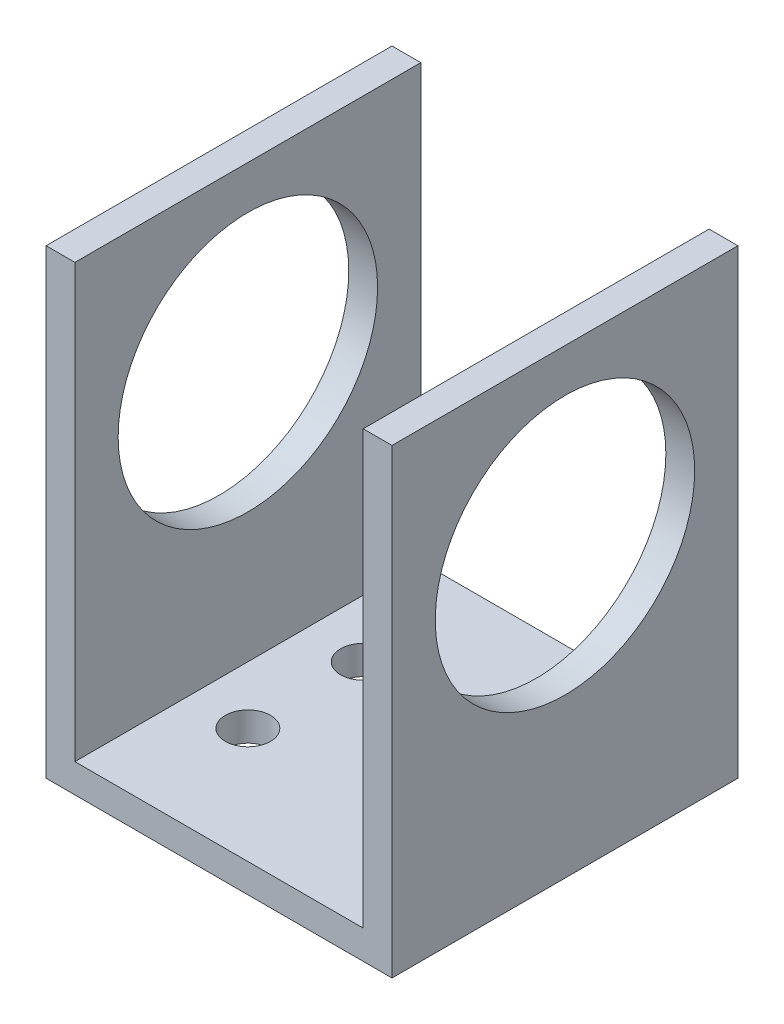
ISO-10303-21;
HEADER;
FILE_DESCRIPTION(('STEP AP214'),'2;1');
FILE_NAME('part.step','',(''),(''),'','','');
FILE_SCHEMA(('AUTOMOTIVE_DESIGN { 1 0 10303 214 1 1 1 1 }'));
ENDSEC;
DATA;
#1=APPLICATION_CONTEXT('core data for automotive mechanical design processes');
#2=APPLICATION_PROTOCOL_DEFINITION('international standard','automotive_design',2000,#1);
#3=PRODUCT_CONTEXT('',#1,'mechanical');
#4=PRODUCT('Part','Part','',(#3));
#5=PRODUCT_RELATED_PRODUCT_CATEGORY('part','',(#4));
#6=PRODUCT_DEFINITION_FORMATION('','',#4);
#7=PRODUCT_DEFINITION_CONTEXT('part definition',#1,'design');
#8=PRODUCT_DEFINITION('design','',#6,#7);
#9=PRODUCT_DEFINITION_SHAPE('','',#8);
#10=(LENGTH_UNIT() NAMED_UNIT(*) SI_UNIT(.MILLI.,.METRE.));
#11=(NAMED_UNIT(*) PLANE_ANGLE_UNIT() SI_UNIT($,.RADIAN.));
#12=(NAMED_UNIT(*) SI_UNIT($,.STERADIAN.) SOLID_ANGLE_UNIT());
#13=UNCERTAINTY_MEASURE_WITH_UNIT(LENGTH_MEASURE(1.E-05),#10,'distance_accuracy_value','');
#14=(GEOMETRIC_REPRESENTATION_CONTEXT(3) GLOBAL_UNCERTAINTY_ASSIGNED_CONTEXT((#13)) GLOBAL_UNIT_ASSIGNED_CONTEXT((#10,
#11,#12)) REPRESENTATION_CONTEXT('',''));
#15=CARTESIAN_POINT('',(0.,0.,0.));
#16=DIRECTION('',(0.,0.,1.));
#17=DIRECTION('',(1.,0.,0.));
#18=AXIS2_PLACEMENT_3D('',#15,#16,#17);
#19=CARTESIAN_POINT('',(38.1,0.,38.1));
#20=DIRECTION('',(0.,1.,0.));
#21=DIRECTION('',(0.,0.,1.));
#22=AXIS2_PLACEMENT_3D('',#19,#20,#21);
#23=PLANE('',#22);
#24=CARTESIAN_POINT('',(28.575,0.,12.7));
#25=DIRECTION('',(0.,1.,0.));
#26=DIRECTION('',(-1.,0.,0.));
#27=AXIS2_PLACEMENT_3D('',#24,#25,#26);
#28=CIRCLE('',#27,2.4892);
#29=CARTESIAN_POINT('',(26.0858,0.,12.7));
#30=VERTEX_POINT('',#29);
#31=EDGE_CURVE('E198',#30,#30,#28,.T.);
#32=ORIENTED_EDGE('',*,*,#31,.T.);
#33=EDGE_LOOP('',(#32));
#34=FACE_BOUND('',#33,.T.);
#35=CARTESIAN_POINT('',(28.575,0.,25.4));
#36=DIRECTION('',(0.,1.,0.));
#37=DIRECTION('',(-1.,0.,0.));
#38=AXIS2_PLACEMENT_3D('',#35,#36,#37);
#39=CIRCLE('',#38,2.4892);
#40=CARTESIAN_POINT('',(26.0858,0.,25.4));
#41=VERTEX_POINT('',#40);
#42=EDGE_CURVE('E204',#41,#41,#39,.T.);
#43=ORIENTED_EDGE('',*,*,#42,.T.);
#44=EDGE_LOOP('',(#43));
#45=FACE_BOUND('',#44,.T.);
#46=CARTESIAN_POINT('',(9.52499999999999,0.,25.4));
#47=DIRECTION('',(0.,1.,0.));
#48=DIRECTION('',(-1.,0.,0.));
#49=AXIS2_PLACEMENT_3D('',#46,#47,#48);
#50=CIRCLE('',#49,2.4892);
#51=CARTESIAN_POINT('',(7.03579999999999,0.,25.4));
#52=VERTEX_POINT('',#51);
#53=EDGE_CURVE('E192',#52,#52,#50,.T.);
#54=ORIENTED_EDGE('',*,*,#53,.T.);
#55=EDGE_LOOP('',(#54));
#56=FACE_BOUND('',#55,.T.);
#57=CARTESIAN_POINT('',(9.52499999999999,0.,12.7));
#58=DIRECTION('',(0.,1.,0.));
#59=DIRECTION('',(-1.,0.,0.));
#60=AXIS2_PLACEMENT_3D('',#57,#58,#59);
#61=CIRCLE('',#60,2.4892);
#62=CARTESIAN_POINT('',(7.03579999999999,0.,12.7));
#63=VERTEX_POINT('',#62);
#64=EDGE_CURVE('E186',#63,#63,#61,.T.);
#65=ORIENTED_EDGE('',*,*,#64,.T.);
#66=EDGE_LOOP('',(#65));
#67=FACE_BOUND('',#66,.T.);
#68=DIRECTION('',(1.,0.,0.));
#69=VECTOR('',#68,1.);
#70=CARTESIAN_POINT('',(38.1,0.,0.));
#71=LINE('',#70,#69);
#72=CARTESIAN_POINT('',(0.,0.,0.));
#73=VERTEX_POINT('',#72);
#74=CARTESIAN_POINT('',(38.1,0.,0.));
#75=VERTEX_POINT('',#74);
#76=EDGE_CURVE('E129',#73,#75,#71,.T.);
#77=ORIENTED_EDGE('',*,*,#76,.T.);
#78=DIRECTION('',(0.,0.,-1.));
#79=VECTOR('',#78,1.);
#80=CARTESIAN_POINT('',(38.1,0.,38.1));
#81=LINE('',#80,#79);
#82=CARTESIAN_POINT('',(38.1,0.,38.1));
#83=VERTEX_POINT('',#82);
#84=EDGE_CURVE('E11',#83,#75,#81,.T.);
#85=ORIENTED_EDGE('',*,*,#84,.F.);
#86=DIRECTION('',(1.,0.,0.));
#87=VECTOR('',#86,1.);
#88=CARTESIAN_POINT('',(38.1,0.,38.1));
#89=LINE('',#88,#87);
#90=CARTESIAN_POINT('',(0.,0.,38.1));
#91=VERTEX_POINT('',#90);
#92=EDGE_CURVE('E144',#91,#83,#89,.T.);
#93=ORIENTED_EDGE('',*,*,#92,.F.);
#94=DIRECTION('',(0.,0.,-1.));
#95=VECTOR('',#94,1.);
#96=CARTESIAN_POINT('',(0.,0.,38.1));
#97=LINE('',#96,#95);
#98=EDGE_CURVE('E125',#91,#73,#97,.T.);
#99=ORIENTED_EDGE('',*,*,#98,.T.);
#100=EDGE_LOOP('',(#77,#85,#93,#99));
#101=FACE_BOUND('',#100,.T.);
#102=ADVANCED_FACE('F33',(#34,#45,#56,#67,#101),#23,.F.);
#103=CARTESIAN_POINT('',(38.1,50.8,38.1));
#104=DIRECTION('',(-1.,0.,0.));
#105=DIRECTION('',(0.,0.,1.));
#106=AXIS2_PLACEMENT_3D('',#103,#104,#105);
#107=PLANE('',#106);
#108=CARTESIAN_POINT('',(38.1,31.75,19.05));
#109=DIRECTION('',(1.,0.,0.));
#110=DIRECTION('',(0.,0.,-1.));
#111=AXIS2_PLACEMENT_3D('',#108,#109,#110);
#112=CIRCLE('',#111,14.2875);
#113=CARTESIAN_POINT('',(38.1,31.75,4.7625));
#114=VERTEX_POINT('',#113);
#115=EDGE_CURVE('E183',#114,#114,#112,.T.);
#116=ORIENTED_EDGE('',*,*,#115,.F.);
#117=EDGE_LOOP('',(#116));
#118=FACE_BOUND('',#117,.T.);
#119=DIRECTION('',(0.,1.,0.));
#120=VECTOR('',#119,1.);
#121=CARTESIAN_POINT('',(38.1,50.8,0.));
#122=LINE('',#121,#120);
#123=CARTESIAN_POINT('',(38.1,50.8,0.));
#124=VERTEX_POINT('',#123);
#125=EDGE_CURVE('E132',#75,#124,#122,.T.);
#126=ORIENTED_EDGE('',*,*,#125,.T.);
#127=DIRECTION('',(0.,0.,-1.));
#128=VECTOR('',#127,1.);
#129=CARTESIAN_POINT('',(38.1,50.8,38.1));
#130=LINE('',#129,#128);
#131=CARTESIAN_POINT('',(38.1,50.8,38.1));
#132=VERTEX_POINT('',#131);
#133=EDGE_CURVE('E41',#132,#124,#130,.T.);
#134=ORIENTED_EDGE('',*,*,#133,.F.);
#135=DIRECTION('',(0.,1.,0.));
#136=VECTOR('',#135,1.);
#137=CARTESIAN_POINT('',(38.1,50.8,38.1));
#138=LINE('',#137,#136);
#139=EDGE_CURVE('E92',#83,#132,#138,.T.);
#140=ORIENTED_EDGE('',*,*,#139,.F.);
#141=ORIENTED_EDGE('',*,*,#84,.T.);
#142=EDGE_LOOP('',(#126,#134,#140,#141));
#143=FACE_BOUND('',#142,.T.);
#144=ADVANCED_FACE('F242',(#118,#143),#107,.F.);
#145=CARTESIAN_POINT('',(34.925,50.8,38.1));
#146=DIRECTION('',(0.,-1.,0.));
#147=DIRECTION('',(0.,0.,-1.));
#148=AXIS2_PLACEMENT_3D('',#145,#146,#147);
#149=PLANE('',#148);
#150=DIRECTION('',(-1.,0.,0.));
#151=VECTOR('',#150,1.);
#152=CARTESIAN_POINT('',(34.925,50.8,0.));
#153=LINE('',#152,#151);
#154=CARTESIAN_POINT('',(34.925,50.8,0.));
#155=VERTEX_POINT('',#154);
#156=EDGE_CURVE('E135',#124,#155,#153,.T.);
#157=ORIENTED_EDGE('',*,*,#156,.T.);
#158=DIRECTION('',(0.,0.,-1.));
#159=VECTOR('',#158,1.);
#160=CARTESIAN_POINT('',(34.925,50.8,38.1));
#161=LINE('',#160,#159);
#162=CARTESIAN_POINT('',(34.925,50.8,38.1));
#163=VERTEX_POINT('',#162);
#164=EDGE_CURVE('E151',#163,#155,#161,.T.);
#165=ORIENTED_EDGE('',*,*,#164,.F.);
#166=DIRECTION('',(-1.,0.,0.));
#167=VECTOR('',#166,1.);
#168=CARTESIAN_POINT('',(34.925,50.8,38.1));
#169=LINE('',#168,#167);
#170=EDGE_CURVE('E159',#132,#163,#169,.T.);
#171=ORIENTED_EDGE('',*,*,#170,.F.);
#172=ORIENTED_EDGE('',*,*,#133,.T.);
#173=EDGE_LOOP('',(#157,#165,#171,#172));
#174=FACE_BOUND('',#173,.T.);
#175=ADVANCED_FACE('F157',(#174),#149,.F.);
#176=CARTESIAN_POINT('',(34.925,3.17499999999998,38.1));
#177=DIRECTION('',(1.,0.,0.));
#178=DIRECTION('',(0.,1.,0.));
#179=AXIS2_PLACEMENT_3D('',#176,#177,#178);
#180=PLANE('',#179);
#181=CARTESIAN_POINT('',(34.925,31.75,19.05));
#182=DIRECTION('',(1.,0.,0.));
#183=DIRECTION('',(0.,1.,0.));
#184=AXIS2_PLACEMENT_3D('',#181,#182,#183);
#185=CIRCLE('',#184,14.2875);
#186=CARTESIAN_POINT('',(34.925,46.0375,19.05));
#187=VERTEX_POINT('',#186);
#188=EDGE_CURVE('E133',#187,#187,#185,.T.);
#189=ORIENTED_EDGE('',*,*,#188,.T.);
#190=EDGE_LOOP('',(#189));
#191=FACE_BOUND('',#190,.T.);
#192=DIRECTION('',(0.,-1.,0.));
#193=VECTOR('',#192,1.);
#194=CARTESIAN_POINT('',(34.925,3.17499999999998,0.));
#195=LINE('',#194,#193);
#196=CARTESIAN_POINT('',(34.925,3.17499999999998,0.));
#197=VERTEX_POINT('',#196);
#198=EDGE_CURVE('E137',#155,#197,#195,.T.);
#199=ORIENTED_EDGE('',*,*,#198,.T.);
#200=DIRECTION('',(0.,0.,-1.));
#201=VECTOR('',#200,1.);
#202=CARTESIAN_POINT('',(34.925,3.17499999999998,38.1));
#203=LINE('',#202,#201);
#204=CARTESIAN_POINT('',(34.925,3.17499999999998,38.1));
#205=VERTEX_POINT('',#204);
#206=EDGE_CURVE('E148',#205,#197,#203,.T.);
#207=ORIENTED_EDGE('',*,*,#206,.F.);
#208=DIRECTION('',(0.,-1.,0.));
#209=VECTOR('',#208,1.);
#210=CARTESIAN_POINT('',(34.925,3.17499999999998,38.1));
#211=LINE('',#210,#209);
#212=EDGE_CURVE('E171',#163,#205,#211,.T.);
#213=ORIENTED_EDGE('',*,*,#212,.F.);
#214=ORIENTED_EDGE('',*,*,#164,.T.);
#215=EDGE_LOOP('',(#199,#207,#213,#214));
#216=FACE_BOUND('',#215,.T.);
#217=ADVANCED_FACE('F167',(#191,#216),#180,.F.);
#218=CARTESIAN_POINT('',(3.17499999999999,3.17499999999999,38.1));
#219=DIRECTION('',(0.,-1.,0.));
#220=DIRECTION('',(1.,0.,0.));
#221=AXIS2_PLACEMENT_3D('',#218,#219,#220);
#222=PLANE('',#221);
#223=CARTESIAN_POINT('',(28.575,3.17499999999998,12.7));
#224=DIRECTION('',(0.,1.,0.));
#225=DIRECTION('',(-1.,0.,0.));
#226=AXIS2_PLACEMENT_3D('',#223,#224,#225);
#227=CIRCLE('',#226,2.4892);
#228=CARTESIAN_POINT('',(26.0858,3.17499999999998,12.7));
#229=VERTEX_POINT('',#228);
#230=EDGE_CURVE('E195',#229,#229,#227,.T.);
#231=ORIENTED_EDGE('',*,*,#230,.F.);
#232=EDGE_LOOP('',(#231));
#233=FACE_BOUND('',#232,.T.);
#234=CARTESIAN_POINT('',(28.575,3.17499999999998,25.4));
#235=DIRECTION('',(0.,1.,0.));
#236=DIRECTION('',(-1.,0.,0.));
#237=AXIS2_PLACEMENT_3D('',#234,#235,#236);
#238=CIRCLE('',#237,2.4892);
#239=CARTESIAN_POINT('',(26.0858,3.17499999999998,25.4));
#240=VERTEX_POINT('',#239);
#241=EDGE_CURVE('E201',#240,#240,#238,.T.);
#242=ORIENTED_EDGE('',*,*,#241,.F.);
#243=EDGE_LOOP('',(#242));
#244=FACE_BOUND('',#243,.T.);
#245=CARTESIAN_POINT('',(9.52499999999999,3.17499999999998,25.4));
#246=DIRECTION('',(0.,1.,0.));
#247=DIRECTION('',(-1.,0.,0.));
#248=AXIS2_PLACEMENT_3D('',#245,#246,#247);
#249=CIRCLE('',#248,2.4892);
#250=CARTESIAN_POINT('',(7.03579999999999,3.17499999999998,25.4));
#251=VERTEX_POINT('',#250);
#252=EDGE_CURVE('E207',#251,#251,#249,.T.);
#253=ORIENTED_EDGE('',*,*,#252,.F.);
#254=EDGE_LOOP('',(#253));
#255=FACE_BOUND('',#254,.T.);
#256=CARTESIAN_POINT('',(9.52499999999999,3.17499999999998,12.7));
#257=DIRECTION('',(0.,1.,0.));
#258=DIRECTION('',(-1.,0.,0.));
#259=AXIS2_PLACEMENT_3D('',#256,#257,#258);
#260=CIRCLE('',#259,2.4892);
#261=CARTESIAN_POINT('',(7.03579999999999,3.17499999999998,12.7));
#262=VERTEX_POINT('',#261);
#263=EDGE_CURVE('E189',#262,#262,#260,.T.);
#264=ORIENTED_EDGE('',*,*,#263,.F.);
#265=EDGE_LOOP('',(#264));
#266=FACE_BOUND('',#265,.T.);
#267=DIRECTION('',(-1.,0.,0.));
#268=VECTOR('',#267,1.);
#269=CARTESIAN_POINT('',(3.17499999999999,3.17499999999999,0.));
#270=LINE('',#269,#268);
#271=CARTESIAN_POINT('',(3.17499999999999,3.17499999999999,0.));
#272=VERTEX_POINT('',#271);
#273=EDGE_CURVE('E139',#197,#272,#270,.T.);
#274=ORIENTED_EDGE('',*,*,#273,.T.);
#275=DIRECTION('',(0.,0.,-1.));
#276=VECTOR('',#275,1.);
#277=CARTESIAN_POINT('',(3.17499999999999,3.17499999999999,38.1));
#278=LINE('',#277,#276);
#279=CARTESIAN_POINT('',(3.17499999999999,3.17499999999999,38.1));
#280=VERTEX_POINT('',#279);
#281=EDGE_CURVE('E120',#280,#272,#278,.T.);
#282=ORIENTED_EDGE('',*,*,#281,.F.);
#283=DIRECTION('',(-1.,0.,0.));
#284=VECTOR('',#283,1.);
#285=CARTESIAN_POINT('',(3.17499999999999,3.17499999999999,38.1));
#286=LINE('',#285,#284);
#287=EDGE_CURVE('E111',#205,#280,#286,.T.);
#288=ORIENTED_EDGE('',*,*,#287,.F.);
#289=ORIENTED_EDGE('',*,*,#206,.T.);
#290=EDGE_LOOP('',(#274,#282,#288,#289));
#291=FACE_BOUND('',#290,.T.);
#292=ADVANCED_FACE('F170',(#233,#244,#255,#266,#291),#222,.F.);
#293=CARTESIAN_POINT('',(3.17499999999999,50.8,38.1));
#294=DIRECTION('',(-1.,0.,0.));
#295=DIRECTION('',(0.,0.,1.));
#296=AXIS2_PLACEMENT_3D('',#293,#294,#295);
#297=PLANE('',#296);
#298=CARTESIAN_POINT('',(3.17499999999999,31.75,19.05));
#299=DIRECTION('',(-1.,0.,0.));
#300=DIRECTION('',(0.,0.,1.));
#301=AXIS2_PLACEMENT_3D('',#298,#299,#300);
#302=CIRCLE('',#301,14.2875);
#303=CARTESIAN_POINT('',(3.17499999999999,31.75,33.3375));
#304=VERTEX_POINT('',#303);
#305=EDGE_CURVE('E179',#304,#304,#302,.T.);
#306=ORIENTED_EDGE('',*,*,#305,.T.);
#307=EDGE_LOOP('',(#306));
#308=FACE_BOUND('',#307,.T.);
#309=DIRECTION('',(0.,1.,0.));
#310=VECTOR('',#309,1.);
#311=CARTESIAN_POINT('',(3.17499999999999,50.8,0.));
#312=LINE('',#311,#310);
#313=CARTESIAN_POINT('',(3.17499999999999,50.8,0.));
#314=VERTEX_POINT('',#313);
#315=EDGE_CURVE('E119',#272,#314,#312,.T.);
#316=ORIENTED_EDGE('',*,*,#315,.T.);
#317=DIRECTION('',(0.,0.,-1.));
#318=VECTOR('',#317,1.);
#319=CARTESIAN_POINT('',(3.17499999999999,50.8,38.1));
#320=LINE('',#319,#318);
#321=CARTESIAN_POINT('',(3.17499999999999,50.8,38.1));
#322=VERTEX_POINT('',#321);
#323=EDGE_CURVE('E116',#322,#314,#320,.T.);
#324=ORIENTED_EDGE('',*,*,#323,.F.);
#325=DIRECTION('',(0.,1.,0.));
#326=VECTOR('',#325,1.);
#327=CARTESIAN_POINT('',(3.17499999999999,50.8,38.1));
#328=LINE('',#327,#326);
#329=EDGE_CURVE('E105',#280,#322,#328,.T.);
#330=ORIENTED_EDGE('',*,*,#329,.F.);
#331=ORIENTED_EDGE('',*,*,#281,.T.);
#332=EDGE_LOOP('',(#316,#324,#330,#331));
#333=FACE_BOUND('',#332,.T.);
#334=ADVANCED_FACE('F117',(#308,#333),#297,.F.);
#335=CARTESIAN_POINT('',(0.,50.8,38.1));
#336=DIRECTION('',(0.,-1.,0.));
#337=DIRECTION('',(0.,0.,-1.));
#338=AXIS2_PLACEMENT_3D('',#335,#336,#337);
#339=PLANE('',#338);
#340=DIRECTION('',(-1.,0.,0.));
#341=VECTOR('',#340,1.);
#342=CARTESIAN_POINT('',(0.,50.8,0.));
#343=LINE('',#342,#341);
#344=CARTESIAN_POINT('',(0.,50.8,0.));
#345=VERTEX_POINT('',#344);
#346=EDGE_CURVE('E78',#314,#345,#343,.T.);
#347=ORIENTED_EDGE('',*,*,#346,.T.);
#348=DIRECTION('',(0.,0.,-1.));
#349=VECTOR('',#348,1.);
#350=CARTESIAN_POINT('',(0.,50.8,38.1));
#351=LINE('',#350,#349);
#352=CARTESIAN_POINT('',(0.,50.8,38.1));
#353=VERTEX_POINT('',#352);
#354=EDGE_CURVE('E121',#353,#345,#351,.T.);
#355=ORIENTED_EDGE('',*,*,#354,.F.);
#356=DIRECTION('',(-1.,0.,0.));
#357=VECTOR('',#356,1.);
#358=CARTESIAN_POINT('',(0.,50.8,38.1));
#359=LINE('',#358,#357);
#360=EDGE_CURVE('E109',#322,#353,#359,.T.);
#361=ORIENTED_EDGE('',*,*,#360,.F.);
#362=ORIENTED_EDGE('',*,*,#323,.T.);
#363=EDGE_LOOP('',(#347,#355,#361,#362));
#364=FACE_BOUND('',#363,.T.);
#365=ADVANCED_FACE('F123',(#364),#339,.F.);
#366=CARTESIAN_POINT('',(0.,0.,38.1));
#367=DIRECTION('',(1.,0.,0.));
#368=DIRECTION('',(0.,0.,-1.));
#369=AXIS2_PLACEMENT_3D('',#366,#367,#368);
#370=PLANE('',#369);
#371=CARTESIAN_POINT('',(0.,31.75,19.05));
#372=DIRECTION('',(1.,0.,0.));
#373=DIRECTION('',(0.,0.,-1.));
#374=AXIS2_PLACEMENT_3D('',#371,#372,#373);
#375=CIRCLE('',#374,14.2875);
#376=CARTESIAN_POINT('',(0.,31.75,4.7625));
#377=VERTEX_POINT('',#376);
#378=EDGE_CURVE('E182',#377,#377,#375,.T.);
#379=ORIENTED_EDGE('',*,*,#378,.T.);
#380=EDGE_LOOP('',(#379));
#381=FACE_BOUND('',#380,.T.);
#382=DIRECTION('',(0.,-1.,0.));
#383=VECTOR('',#382,1.);
#384=CARTESIAN_POINT('',(0.,0.,0.));
#385=LINE('',#384,#383);
#386=EDGE_CURVE('E84',#345,#73,#385,.T.);
#387=ORIENTED_EDGE('',*,*,#386,.T.);
#388=ORIENTED_EDGE('',*,*,#98,.F.);
#389=DIRECTION('',(0.,-1.,0.));
#390=VECTOR('',#389,1.);
#391=CARTESIAN_POINT('',(0.,0.,38.1));
#392=LINE('',#391,#390);
#393=EDGE_CURVE('E49',#353,#91,#392,.T.);
#394=ORIENTED_EDGE('',*,*,#393,.F.);
#395=ORIENTED_EDGE('',*,*,#354,.T.);
#396=EDGE_LOOP('',(#387,#388,#394,#395));
#397=FACE_BOUND('',#396,.T.);
#398=ADVANCED_FACE('F316',(#381,#397),#370,.F.);
#399=CARTESIAN_POINT('',(0.,0.,38.1));
#400=DIRECTION('',(0.,0.,-1.));
#401=DIRECTION('',(-1.,0.,0.));
#402=AXIS2_PLACEMENT_3D('',#399,#400,#401);
#403=PLANE('',#402);
#404=ORIENTED_EDGE('',*,*,#92,.T.);
#405=ORIENTED_EDGE('',*,*,#139,.T.);
#406=ORIENTED_EDGE('',*,*,#170,.T.);
#407=ORIENTED_EDGE('',*,*,#212,.T.);
#408=ORIENTED_EDGE('',*,*,#287,.T.);
#409=ORIENTED_EDGE('',*,*,#329,.T.);
#410=ORIENTED_EDGE('',*,*,#360,.T.);
#411=ORIENTED_EDGE('',*,*,#393,.T.);
#412=EDGE_LOOP('',(#404,#405,#406,#407,#408,#409,#410,#411));
#413=FACE_BOUND('',#412,.T.);
#414=ADVANCED_FACE('F107',(#413),#403,.F.);
#415=CARTESIAN_POINT('',(0.,0.,0.));
#416=DIRECTION('',(0.,0.,-1.));
#417=DIRECTION('',(-1.,0.,0.));
#418=AXIS2_PLACEMENT_3D('',#415,#416,#417);
#419=PLANE('',#418);
#420=ORIENTED_EDGE('',*,*,#76,.F.);
#421=ORIENTED_EDGE('',*,*,#386,.F.);
#422=ORIENTED_EDGE('',*,*,#346,.F.);
#423=ORIENTED_EDGE('',*,*,#315,.F.);
#424=ORIENTED_EDGE('',*,*,#273,.F.);
#425=ORIENTED_EDGE('',*,*,#198,.F.);
#426=ORIENTED_EDGE('',*,*,#156,.F.);
#427=ORIENTED_EDGE('',*,*,#125,.F.);
#428=EDGE_LOOP('',(#420,#421,#422,#423,#424,#425,#426,#427));
#429=FACE_BOUND('',#428,.T.);
#430=ADVANCED_FACE('F163',(#429),#419,.T.);
#431=CARTESIAN_POINT('',(0.,31.75,19.05));
#432=DIRECTION('',(1.,0.,0.));
#433=DIRECTION('',(0.,0.,-1.));
#434=AXIS2_PLACEMENT_3D('',#431,#432,#433);
#435=CYLINDRICAL_SURFACE('',#434,14.2875);
#436=ORIENTED_EDGE('',*,*,#378,.F.);
#437=EDGE_LOOP('',(#436));
#438=FACE_BOUND('',#437,.T.);
#439=ORIENTED_EDGE('',*,*,#305,.F.);
#440=EDGE_LOOP('',(#439));
#441=FACE_BOUND('',#440,.T.);
#442=ADVANCED_FACE('F236',(#438,#441),#435,.F.);
#443=ORIENTED_EDGE('',*,*,#115,.T.);
#444=EDGE_LOOP('',(#443));
#445=FACE_BOUND('',#444,.T.);
#446=ORIENTED_EDGE('',*,*,#188,.F.);
#447=EDGE_LOOP('',(#446));
#448=FACE_BOUND('',#447,.T.);
#449=ADVANCED_FACE('F230',(#445,#448),#435,.F.);
#450=CARTESIAN_POINT('',(9.52499999999999,0.,12.7));
#451=DIRECTION('',(0.,1.,0.));
#452=DIRECTION('',(-1.,0.,0.));
#453=AXIS2_PLACEMENT_3D('',#450,#451,#452);
#454=CYLINDRICAL_SURFACE('',#453,2.4892);
#455=ORIENTED_EDGE('',*,*,#64,.F.);
#456=EDGE_LOOP('',(#455));
#457=FACE_BOUND('',#456,.T.);
#458=ORIENTED_EDGE('',*,*,#263,.T.);
#459=EDGE_LOOP('',(#458));
#460=FACE_BOUND('',#459,.T.);
#461=ADVANCED_FACE('F219',(#457,#460),#454,.F.);
#462=CARTESIAN_POINT('',(9.52499999999999,0.,25.4));
#463=DIRECTION('',(0.,1.,0.));
#464=DIRECTION('',(-1.,0.,0.));
#465=AXIS2_PLACEMENT_3D('',#462,#463,#464);
#466=CYLINDRICAL_SURFACE('',#465,2.4892);
#467=ORIENTED_EDGE('',*,*,#53,.F.);
#468=EDGE_LOOP('',(#467));
#469=FACE_BOUND('',#468,.T.);
#470=ORIENTED_EDGE('',*,*,#252,.T.);
#471=EDGE_LOOP('',(#470));
#472=FACE_BOUND('',#471,.T.);
#473=ADVANCED_FACE('F215',(#469,#472),#466,.F.);
#474=CARTESIAN_POINT('',(28.575,0.,25.4));
#475=DIRECTION('',(0.,1.,0.));
#476=DIRECTION('',(-1.,0.,0.));
#477=AXIS2_PLACEMENT_3D('',#474,#475,#476);
#478=CYLINDRICAL_SURFACE('',#477,2.4892);
#479=ORIENTED_EDGE('',*,*,#42,.F.);
#480=EDGE_LOOP('',(#479));
#481=FACE_BOUND('',#480,.T.);
#482=ORIENTED_EDGE('',*,*,#241,.T.);
#483=EDGE_LOOP('',(#482));
#484=FACE_BOUND('',#483,.T.);
#485=ADVANCED_FACE('F218',(#481,#484),#478,.F.);
#486=CARTESIAN_POINT('',(28.575,0.,12.7));
#487=DIRECTION('',(0.,1.,0.));
#488=DIRECTION('',(-1.,0.,0.));
#489=AXIS2_PLACEMENT_3D('',#486,#487,#488);
#490=CYLINDRICAL_SURFACE('',#489,2.4892);
#491=ORIENTED_EDGE('',*,*,#31,.F.);
#492=EDGE_LOOP('',(#491));
#493=FACE_BOUND('',#492,.T.);
#494=ORIENTED_EDGE('',*,*,#230,.T.);
#495=EDGE_LOOP('',(#494));
#496=FACE_BOUND('',#495,.T.);
#497=ADVANCED_FACE('F254',(#493,#496),#490,.F.);
#498=CLOSED_SHELL('',(#102,#144,#175,#217,#292,#334,#365,#398,#414,#430,#442,#449,#461,#473,
#485,#497));
#499=MANIFOLD_SOLID_BREP('B2',#498);
#500=ADVANCED_BREP_SHAPE_REPRESENTATION('',(#18,#499),#14);
#501=SHAPE_DEFINITION_REPRESENTATION(#9,#500);
ENDSEC;
END-ISO-10303-21;
